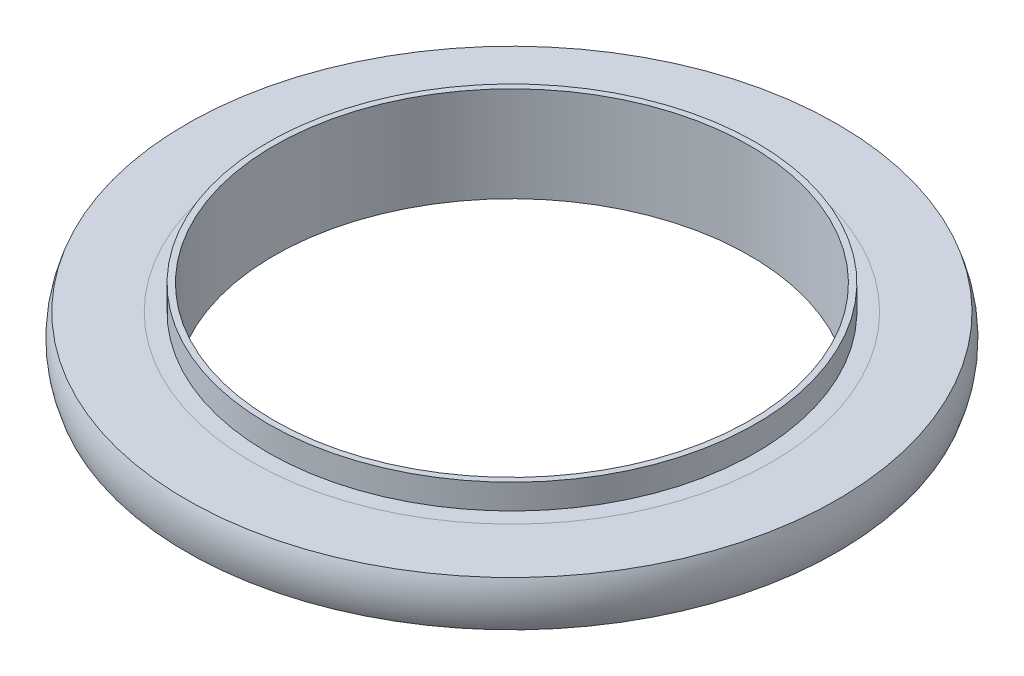
ISO-10303-21;
HEADER;
FILE_DESCRIPTION(('STEP AP214'),'2;1');
FILE_NAME('part.step','',(''),(''),'','','');
FILE_SCHEMA(('AUTOMOTIVE_DESIGN { 1 0 10303 214 1 1 1 1 }'));
ENDSEC;
DATA;
#1=APPLICATION_CONTEXT('core data for automotive mechanical design processes');
#2=APPLICATION_PROTOCOL_DEFINITION('international standard','automotive_design',2000,#1);
#3=PRODUCT_CONTEXT('',#1,'mechanical');
#4=PRODUCT('Part','Part','',(#3));
#5=PRODUCT_RELATED_PRODUCT_CATEGORY('part','',(#4));
#6=PRODUCT_DEFINITION_FORMATION('','',#4);
#7=PRODUCT_DEFINITION_CONTEXT('part definition',#1,'design');
#8=PRODUCT_DEFINITION('design','',#6,#7);
#9=PRODUCT_DEFINITION_SHAPE('','',#8);
#10=(LENGTH_UNIT() NAMED_UNIT(*) SI_UNIT(.MILLI.,.METRE.));
#11=(NAMED_UNIT(*) PLANE_ANGLE_UNIT() SI_UNIT($,.RADIAN.));
#12=(NAMED_UNIT(*) SI_UNIT($,.STERADIAN.) SOLID_ANGLE_UNIT());
#13=UNCERTAINTY_MEASURE_WITH_UNIT(LENGTH_MEASURE(1.E-05),#10,'distance_accuracy_value','');
#14=(GEOMETRIC_REPRESENTATION_CONTEXT(3) GLOBAL_UNCERTAINTY_ASSIGNED_CONTEXT((#13)) GLOBAL_UNIT_ASSIGNED_CONTEXT((#10,
#11,#12)) REPRESENTATION_CONTEXT('',''));
#15=CARTESIAN_POINT('',(0.,0.,0.));
#16=DIRECTION('',(0.,0.,1.));
#17=DIRECTION('',(1.,0.,0.));
#18=AXIS2_PLACEMENT_3D('',#15,#16,#17);
#19=CARTESIAN_POINT('',(0.,0.,0.));
#20=DIRECTION('',(0.,-1.,0.));
#21=DIRECTION('',(0.,0.,-1.));
#22=AXIS2_PLACEMENT_3D('',#19,#20,#21);
#23=TOROIDAL_SURFACE('',#22,26.8,5.3);
#24=CARTESIAN_POINT('',(0.,-1.905,0.));
#25=DIRECTION('',(0.,-1.,0.));
#26=DIRECTION('',(0.,0.,-1.));
#27=AXIS2_PLACEMENT_3D('',#24,#25,#26);
#28=CIRCLE('',#27,21.8541962230594);
#29=CARTESIAN_POINT('',(0.,-1.905,-21.8541962230594));
#30=VERTEX_POINT('',#29);
#31=EDGE_CURVE('E11',#30,#30,#28,.T.);
#32=ORIENTED_EDGE('',*,*,#31,.T.);
#33=EDGE_LOOP('',(#32));
#34=FACE_BOUND('',#33,.T.);
#35=CARTESIAN_POINT('',(0.,1.905,0.));
#36=DIRECTION('',(0.,-1.,0.));
#37=DIRECTION('',(0.,0.,-1.));
#38=AXIS2_PLACEMENT_3D('',#35,#36,#37);
#39=CIRCLE('',#38,21.8541962230594);
#40=CARTESIAN_POINT('',(0.,1.905,-21.8541962230594));
#41=VERTEX_POINT('',#40);
#42=EDGE_CURVE('E56',#41,#41,#39,.T.);
#43=ORIENTED_EDGE('',*,*,#42,.F.);
#44=EDGE_LOOP('',(#43));
#45=FACE_BOUND('',#44,.T.);
#46=ADVANCED_FACE('F42',(#34,#45),#23,.T.);
#47=CARTESIAN_POINT('',(21.8541962230594,-1.905,0.));
#48=DIRECTION('',(0.,-1.,0.));
#49=DIRECTION('',(0.,0.,-1.));
#50=AXIS2_PLACEMENT_3D('',#47,#48,#49);
#51=PLANE('',#50);
#52=CARTESIAN_POINT('',(0.,-1.905,0.));
#53=DIRECTION('',(0.,-1.,0.));
#54=DIRECTION('',(0.,0.,-1.));
#55=AXIS2_PLACEMENT_3D('',#52,#53,#54);
#56=CIRCLE('',#55,27.3458037769406);
#57=CARTESIAN_POINT('',(0.,-1.905,-27.3458037769406));
#58=VERTEX_POINT('',#57);
#59=EDGE_CURVE('E48',#58,#58,#56,.T.);
#60=ORIENTED_EDGE('',*,*,#59,.T.);
#61=EDGE_LOOP('',(#60));
#62=FACE_BOUND('',#61,.T.);
#63=ORIENTED_EDGE('',*,*,#31,.F.);
#64=EDGE_LOOP('',(#63));
#65=FACE_BOUND('',#64,.T.);
#66=ADVANCED_FACE('F66',(#62,#65),#51,.T.);
#67=CARTESIAN_POINT('',(0.,0.,0.));
#68=DIRECTION('',(0.,-1.,0.));
#69=DIRECTION('',(0.,0.,-1.));
#70=AXIS2_PLACEMENT_3D('',#67,#68,#69);
#71=TOROIDAL_SURFACE('',#70,22.4,5.3);
#72=CARTESIAN_POINT('',(0.,1.905,0.));
#73=DIRECTION('',(0.,-1.,0.));
#74=DIRECTION('',(0.,0.,-1.));
#75=AXIS2_PLACEMENT_3D('',#72,#73,#74);
#76=CIRCLE('',#75,27.3458037769406);
#77=CARTESIAN_POINT('',(0.,1.905,-27.3458037769406));
#78=VERTEX_POINT('',#77);
#79=EDGE_CURVE('E52',#78,#78,#76,.T.);
#80=ORIENTED_EDGE('',*,*,#79,.T.);
#81=EDGE_LOOP('',(#80));
#82=FACE_BOUND('',#81,.T.);
#83=ORIENTED_EDGE('',*,*,#59,.F.);
#84=EDGE_LOOP('',(#83));
#85=FACE_BOUND('',#84,.T.);
#86=ADVANCED_FACE('F70',(#82,#85),#71,.T.);
#87=CARTESIAN_POINT('',(21.8541962230594,1.905,0.));
#88=DIRECTION('',(0.,1.,0.));
#89=DIRECTION('',(0.,0.,1.));
#90=AXIS2_PLACEMENT_3D('',#87,#88,#89);
#91=PLANE('',#90);
#92=ORIENTED_EDGE('',*,*,#42,.T.);
#93=EDGE_LOOP('',(#92));
#94=FACE_BOUND('',#93,.T.);
#95=ORIENTED_EDGE('',*,*,#79,.F.);
#96=EDGE_LOOP('',(#95));
#97=FACE_BOUND('',#96,.T.);
#98=ADVANCED_FACE('F62',(#94,#97),#91,.T.);
#99=CLOSED_SHELL('',(#46,#66,#86,#98));
#100=MANIFOLD_SOLID_BREP('B2',#99);
#101=CARTESIAN_POINT('',(20.,4.,0.));
#102=DIRECTION('',(0.,-1.,0.));
#103=DIRECTION('',(0.,0.,-1.));
#104=AXIS2_PLACEMENT_3D('',#101,#102,#103);
#105=PLANE('',#104);
#106=CARTESIAN_POINT('',(0.,4.,0.));
#107=DIRECTION('',(0.,1.,0.));
#108=DIRECTION('',(0.,0.,1.));
#109=AXIS2_PLACEMENT_3D('',#106,#107,#108);
#110=CIRCLE('',#109,20.);
#111=CARTESIAN_POINT('',(0.,4.,20.));
#112=VERTEX_POINT('',#111);
#113=EDGE_CURVE('E41',#112,#112,#110,.T.);
#114=ORIENTED_EDGE('',*,*,#113,.F.);
#115=EDGE_LOOP('',(#114));
#116=FACE_BOUND('',#115,.T.);
#117=CARTESIAN_POINT('',(0.,4.,0.));
#118=DIRECTION('',(0.,1.,0.));
#119=DIRECTION('',(0.,0.,1.));
#120=AXIS2_PLACEMENT_3D('',#117,#118,#119);
#121=CIRCLE('',#120,20.5);
#122=CARTESIAN_POINT('',(0.,4.,20.5));
#123=VERTEX_POINT('',#122);
#124=EDGE_CURVE('E131',#123,#123,#121,.T.);
#125=ORIENTED_EDGE('',*,*,#124,.T.);
#126=EDGE_LOOP('',(#125));
#127=FACE_BOUND('',#126,.T.);
#128=ADVANCED_FACE('F103',(#116,#127),#105,.F.);
#129=CARTESIAN_POINT('',(0.,4.,0.));
#130=DIRECTION('',(0.,1.,0.));
#131=DIRECTION('',(0.,0.,1.));
#132=AXIS2_PLACEMENT_3D('',#129,#130,#131);
#133=CYLINDRICAL_SURFACE('',#132,20.);
#134=CARTESIAN_POINT('',(0.,-4.,0.));
#135=DIRECTION('',(0.,1.,0.));
#136=DIRECTION('',(0.,0.,1.));
#137=AXIS2_PLACEMENT_3D('',#134,#135,#136);
#138=CIRCLE('',#137,20.);
#139=CARTESIAN_POINT('',(0.,-4.,20.));
#140=VERTEX_POINT('',#139);
#141=EDGE_CURVE('E109',#140,#140,#138,.T.);
#142=ORIENTED_EDGE('',*,*,#141,.F.);
#143=EDGE_LOOP('',(#142));
#144=FACE_BOUND('',#143,.T.);
#145=ORIENTED_EDGE('',*,*,#113,.T.);
#146=EDGE_LOOP('',(#145));
#147=FACE_BOUND('',#146,.T.);
#148=ADVANCED_FACE('F168',(#144,#147),#133,.F.);
#149=CARTESIAN_POINT('',(20.,-4.,0.));
#150=DIRECTION('',(0.,1.,0.));
#151=DIRECTION('',(0.,0.,1.));
#152=AXIS2_PLACEMENT_3D('',#149,#150,#151);
#153=PLANE('',#152);
#154=CARTESIAN_POINT('',(0.,-4.,0.));
#155=DIRECTION('',(0.,1.,0.));
#156=DIRECTION('',(0.,0.,1.));
#157=AXIS2_PLACEMENT_3D('',#154,#155,#156);
#158=CIRCLE('',#157,20.5);
#159=CARTESIAN_POINT('',(0.,-4.,20.5));
#160=VERTEX_POINT('',#159);
#161=EDGE_CURVE('E113',#160,#160,#158,.T.);
#162=ORIENTED_EDGE('',*,*,#161,.F.);
#163=EDGE_LOOP('',(#162));
#164=FACE_BOUND('',#163,.T.);
#165=ORIENTED_EDGE('',*,*,#141,.T.);
#166=EDGE_LOOP('',(#165));
#167=FACE_BOUND('',#166,.T.);
#168=ADVANCED_FACE('F163',(#164,#167),#153,.F.);
#169=CARTESIAN_POINT('',(0.,4.,0.));
#170=DIRECTION('',(0.,1.,0.));
#171=DIRECTION('',(0.,0.,1.));
#172=AXIS2_PLACEMENT_3D('',#169,#170,#171);
#173=CYLINDRICAL_SURFACE('',#172,20.5);
#174=CARTESIAN_POINT('',(0.,-1.905,0.));
#175=DIRECTION('',(0.,1.,0.));
#176=DIRECTION('',(0.,0.,1.));
#177=AXIS2_PLACEMENT_3D('',#174,#175,#176);
#178=CIRCLE('',#177,20.5);
#179=CARTESIAN_POINT('',(0.,-1.905,20.5));
#180=VERTEX_POINT('',#179);
#181=EDGE_CURVE('E117',#180,#180,#178,.T.);
#182=ORIENTED_EDGE('',*,*,#181,.F.);
#183=EDGE_LOOP('',(#182));
#184=FACE_BOUND('',#183,.T.);
#185=ORIENTED_EDGE('',*,*,#161,.T.);
#186=EDGE_LOOP('',(#185));
#187=FACE_BOUND('',#186,.T.);
#188=ADVANCED_FACE('F157',(#184,#187),#173,.T.);
#189=CARTESIAN_POINT('',(20.5,-1.905,0.));
#190=DIRECTION('',(0.,1.,0.));
#191=DIRECTION('',(0.,0.,1.));
#192=AXIS2_PLACEMENT_3D('',#189,#190,#191);
#193=PLANE('',#192);
#194=CARTESIAN_POINT('',(0.,-1.905,0.));
#195=DIRECTION('',(0.,1.,0.));
#196=DIRECTION('',(0.,0.,1.));
#197=AXIS2_PLACEMENT_3D('',#194,#195,#196);
#198=CIRCLE('',#197,21.8541962230594);
#199=CARTESIAN_POINT('',(0.,-1.905,21.8541962230594));
#200=VERTEX_POINT('',#199);
#201=EDGE_CURVE('E122',#200,#200,#198,.T.);
#202=ORIENTED_EDGE('',*,*,#201,.F.);
#203=EDGE_LOOP('',(#202));
#204=FACE_BOUND('',#203,.T.);
#205=ORIENTED_EDGE('',*,*,#181,.T.);
#206=EDGE_LOOP('',(#205));
#207=FACE_BOUND('',#206,.T.);
#208=ADVANCED_FACE('F151',(#204,#207),#193,.F.);
#209=CARTESIAN_POINT('',(0.,0.,0.));
#210=DIRECTION('',(0.,1.,0.));
#211=DIRECTION('',(0.,0.,1.));
#212=AXIS2_PLACEMENT_3D('',#209,#210,#211);
#213=TOROIDAL_SURFACE('',#212,26.8,5.3);
#214=CARTESIAN_POINT('',(0.,1.905,0.));
#215=DIRECTION('',(0.,1.,0.));
#216=DIRECTION('',(0.,0.,1.));
#217=AXIS2_PLACEMENT_3D('',#214,#215,#216);
#218=CIRCLE('',#217,21.8541962230594);
#219=CARTESIAN_POINT('',(0.,1.905,21.8541962230594));
#220=VERTEX_POINT('',#219);
#221=EDGE_CURVE('E125',#220,#220,#218,.T.);
#222=ORIENTED_EDGE('',*,*,#221,.F.);
#223=EDGE_LOOP('',(#222));
#224=FACE_BOUND('',#223,.T.);
#225=ORIENTED_EDGE('',*,*,#201,.T.);
#226=EDGE_LOOP('',(#225));
#227=FACE_BOUND('',#226,.T.);
#228=ADVANCED_FACE('F145',(#224,#227),#213,.F.);
#229=CARTESIAN_POINT('',(20.5,1.905,0.));
#230=DIRECTION('',(0.,-1.,0.));
#231=DIRECTION('',(0.,0.,-1.));
#232=AXIS2_PLACEMENT_3D('',#229,#230,#231);
#233=PLANE('',#232);
#234=CARTESIAN_POINT('',(0.,1.905,0.));
#235=DIRECTION('',(0.,1.,0.));
#236=DIRECTION('',(0.,0.,1.));
#237=AXIS2_PLACEMENT_3D('',#234,#235,#236);
#238=CIRCLE('',#237,20.5);
#239=CARTESIAN_POINT('',(0.,1.905,20.5));
#240=VERTEX_POINT('',#239);
#241=EDGE_CURVE('E128',#240,#240,#238,.T.);
#242=ORIENTED_EDGE('',*,*,#241,.F.);
#243=EDGE_LOOP('',(#242));
#244=FACE_BOUND('',#243,.T.);
#245=ORIENTED_EDGE('',*,*,#221,.T.);
#246=EDGE_LOOP('',(#245));
#247=FACE_BOUND('',#246,.T.);
#248=ADVANCED_FACE('F139',(#244,#247),#233,.F.);
#249=CARTESIAN_POINT('',(0.,4.,0.));
#250=DIRECTION('',(0.,1.,0.));
#251=DIRECTION('',(0.,0.,1.));
#252=AXIS2_PLACEMENT_3D('',#249,#250,#251);
#253=CYLINDRICAL_SURFACE('',#252,20.5);
#254=ORIENTED_EDGE('',*,*,#124,.F.);
#255=EDGE_LOOP('',(#254));
#256=FACE_BOUND('',#255,.T.);
#257=ORIENTED_EDGE('',*,*,#241,.T.);
#258=EDGE_LOOP('',(#257));
#259=FACE_BOUND('',#258,.T.);
#260=ADVANCED_FACE('F136',(#256,#259),#253,.T.);
#261=CLOSED_SHELL('',(#128,#148,#168,#188,#208,#228,#248,#260));
#262=MANIFOLD_SOLID_BREP('B6',#261);
#263=ADVANCED_BREP_SHAPE_REPRESENTATION('',(#18,#100,#262),#14);
#264=SHAPE_DEFINITION_REPRESENTATION(#9,#263);
ENDSEC;
END-ISO-10303-21;
